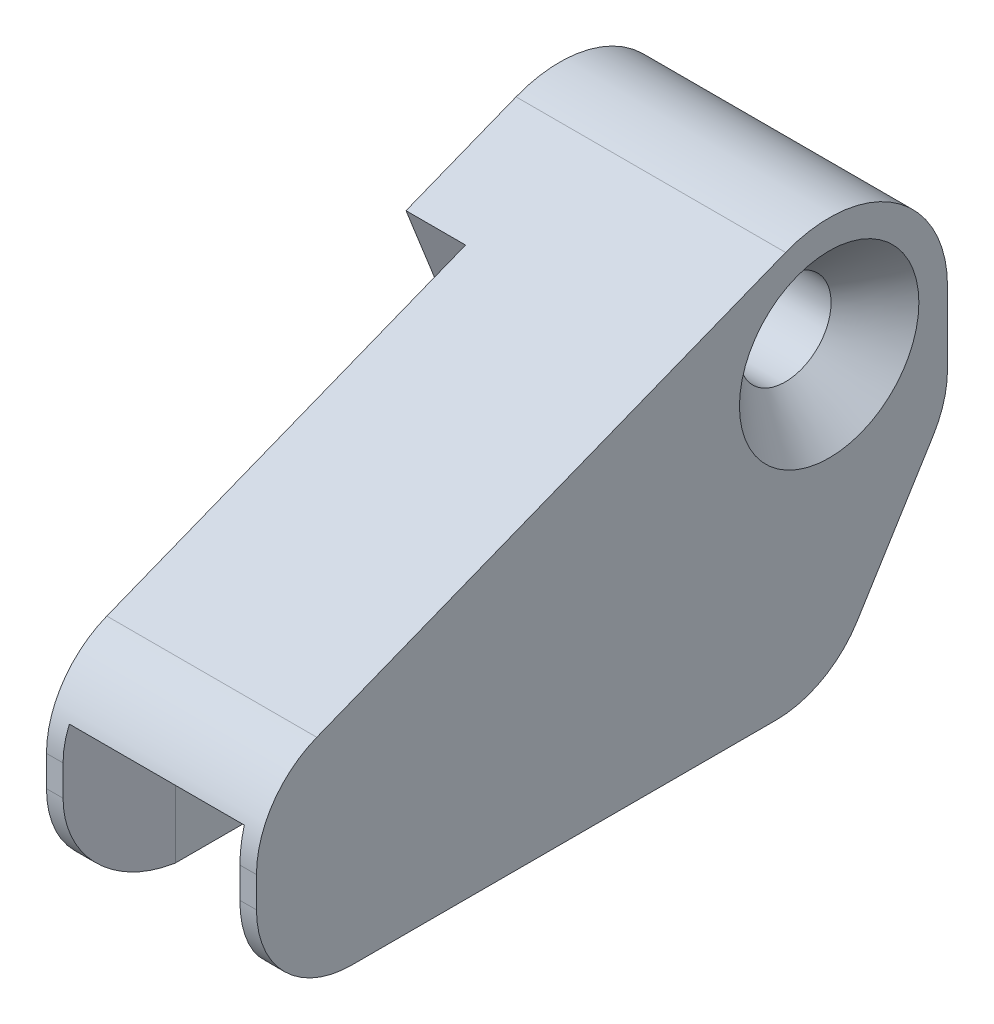
ISO-10303-21;
HEADER;
FILE_DESCRIPTION(('STEP AP214'),'2;1');
FILE_NAME('part.step','',(''),(''),'','','');
FILE_SCHEMA(('AUTOMOTIVE_DESIGN { 1 0 10303 214 1 1 1 1 }'));
ENDSEC;
DATA;
#1=APPLICATION_CONTEXT('core data for automotive mechanical design processes');
#2=APPLICATION_PROTOCOL_DEFINITION('international standard','automotive_design',2000,#1);
#3=PRODUCT_CONTEXT('',#1,'mechanical');
#4=PRODUCT('Part','Part','',(#3));
#5=PRODUCT_RELATED_PRODUCT_CATEGORY('part','',(#4));
#6=PRODUCT_DEFINITION_FORMATION('','',#4);
#7=PRODUCT_DEFINITION_CONTEXT('part definition',#1,'design');
#8=PRODUCT_DEFINITION('design','',#6,#7);
#9=PRODUCT_DEFINITION_SHAPE('','',#8);
#10=(LENGTH_UNIT() NAMED_UNIT(*) SI_UNIT(.MILLI.,.METRE.));
#11=(NAMED_UNIT(*) PLANE_ANGLE_UNIT() SI_UNIT($,.RADIAN.));
#12=(NAMED_UNIT(*) SI_UNIT($,.STERADIAN.) SOLID_ANGLE_UNIT());
#13=UNCERTAINTY_MEASURE_WITH_UNIT(LENGTH_MEASURE(1.E-05),#10,'distance_accuracy_value','');
#14=(GEOMETRIC_REPRESENTATION_CONTEXT(3) GLOBAL_UNCERTAINTY_ASSIGNED_CONTEXT((#13)) GLOBAL_UNIT_ASSIGNED_CONTEXT((#10,
#11,#12)) REPRESENTATION_CONTEXT('',''));
#15=CARTESIAN_POINT('',(0.,0.,0.));
#16=DIRECTION('',(0.,0.,1.));
#17=DIRECTION('',(1.,0.,0.));
#18=AXIS2_PLACEMENT_3D('',#15,#16,#17);
#19=CARTESIAN_POINT('',(11.,-5.2,-6.2));
#20=DIRECTION('',(0.,0.526939668861675,0.84990269171238));
#21=DIRECTION('',(0.,-0.84990269171238,0.526939668861675));
#22=AXIS2_PLACEMENT_3D('',#19,#20,#21);
#23=PLANE('',#22);
#24=DIRECTION('',(0.,-0.84990269171238,0.526939668861675));
#25=VECTOR('',#24,1.);
#26=CARTESIAN_POINT('',(9.25,-8.62041058295059,-4.07934543857064));
#27=LINE('',#26,#25);
#28=CARTESIAN_POINT('',(9.25,-6.41046216360984,-5.4495134585619));
#29=VERTEX_POINT('',#28);
#30=CARTESIAN_POINT('',(9.25,-12.8346983443084,-1.46648702652881));
#31=VERTEX_POINT('',#30);
#32=EDGE_CURVE('E69',#29,#31,#27,.T.);
#33=ORIENTED_EDGE('',*,*,#32,.F.);
#34=DIRECTION('',(-1.,0.,0.));
#35=VECTOR('',#34,1.);
#36=CARTESIAN_POINT('',(11.,-6.41046216360984,-5.4495134585619));
#37=LINE('',#36,#35);
#38=CARTESIAN_POINT('',(11.,-6.41046216360984,-5.4495134585619));
#39=VERTEX_POINT('',#38);
#40=EDGE_CURVE('E375',#29,#39,#37,.F.);
#41=ORIENTED_EDGE('',*,*,#40,.T.);
#42=DIRECTION('',(0.,0.849902691712379,-0.526939668861675));
#43=VECTOR('',#42,1.);
#44=CARTESIAN_POINT('',(11.,-5.2,-6.2));
#45=LINE('',#44,#43);
#46=CARTESIAN_POINT('',(11.,-12.8346983443084,-1.46648702652881));
#47=VERTEX_POINT('',#46);
#48=EDGE_CURVE('E275',#47,#39,#45,.T.);
#49=ORIENTED_EDGE('',*,*,#48,.F.);
#50=DIRECTION('',(-1.,0.,0.));
#51=VECTOR('',#50,1.);
#52=CARTESIAN_POINT('',(11.,-12.8346983443084,-1.46648702652881));
#53=LINE('',#52,#51);
#54=EDGE_CURVE('E369',#47,#31,#53,.T.);
#55=ORIENTED_EDGE('',*,*,#54,.T.);
#56=EDGE_LOOP('',(#33,#41,#49,#55));
#57=FACE_BOUND('',#56,.T.);
#58=ADVANCED_FACE('F42',(#57),#23,.F.);
#59=CARTESIAN_POINT('',(11.,-15.2,30.));
#60=DIRECTION('',(0.,0.,-1.));
#61=DIRECTION('',(0.,1.,0.));
#62=AXIS2_PLACEMENT_3D('',#59,#60,#61);
#63=PLANE('',#62);
#64=DIRECTION('',(0.,-1.,0.));
#65=VECTOR('',#64,1.);
#66=CARTESIAN_POINT('',(11.,-15.2,30.));
#67=LINE('',#66,#65);
#68=CARTESIAN_POINT('',(11.,-8.59908763706365,30.));
#69=VERTEX_POINT('',#68);
#70=CARTESIAN_POINT('',(11.,-10.2,30.));
#71=VERTEX_POINT('',#70);
#72=EDGE_CURVE('E222',#69,#71,#67,.T.);
#73=ORIENTED_EDGE('',*,*,#72,.F.);
#74=DIRECTION('',(-1.,0.,0.));
#75=VECTOR('',#74,1.);
#76=CARTESIAN_POINT('',(11.,-8.59908763706365,30.));
#77=LINE('',#76,#75);
#78=CARTESIAN_POINT('',(10.1316349035423,-8.59908763706365,30.));
#79=VERTEX_POINT('',#78);
#80=EDGE_CURVE('E329',#69,#79,#77,.T.);
#81=ORIENTED_EDGE('',*,*,#80,.T.);
#82=DIRECTION('',(0.,-1.,0.));
#83=VECTOR('',#82,1.);
#84=CARTESIAN_POINT('',(10.1316349035423,-15.2,30.));
#85=LINE('',#84,#83);
#86=CARTESIAN_POINT('',(10.1316349035423,-10.2,30.));
#87=VERTEX_POINT('',#86);
#88=EDGE_CURVE('E310',#79,#87,#85,.T.);
#89=ORIENTED_EDGE('',*,*,#88,.T.);
#90=DIRECTION('',(-1.,0.,0.));
#91=VECTOR('',#90,1.);
#92=CARTESIAN_POINT('',(11.,-10.2,30.));
#93=LINE('',#92,#91);
#94=EDGE_CURVE('E322',#87,#71,#93,.F.);
#95=ORIENTED_EDGE('',*,*,#94,.T.);
#96=EDGE_LOOP('',(#73,#81,#89,#95));
#97=FACE_BOUND('',#96,.T.);
#98=ADVANCED_FACE('F451',(#97),#63,.F.);
#99=CARTESIAN_POINT('',(11.,-15.2,0.));
#100=DIRECTION('',(0.,1.,0.));
#101=DIRECTION('',(0.,0.,1.));
#102=AXIS2_PLACEMENT_3D('',#99,#100,#101);
#103=PLANE('',#102);
#104=DIRECTION('',(0.,0.,-1.));
#105=VECTOR('',#104,1.);
#106=CARTESIAN_POINT('',(0.,-15.2,0.));
#107=LINE('',#106,#105);
#108=CARTESIAN_POINT('',(0.,-15.2,25.));
#109=VERTEX_POINT('',#108);
#110=CARTESIAN_POINT('',(0.,-15.2,2.78302643203309));
#111=VERTEX_POINT('',#110);
#112=EDGE_CURVE('E261',#109,#111,#107,.T.);
#113=ORIENTED_EDGE('',*,*,#112,.T.);
#114=DIRECTION('',(-1.,0.,0.));
#115=VECTOR('',#114,1.);
#116=CARTESIAN_POINT('',(11.,-15.2,2.78302643203309));
#117=LINE('',#116,#115);
#118=CARTESIAN_POINT('',(1.75,-15.2,2.78302643203309));
#119=VERTEX_POINT('',#118);
#120=EDGE_CURVE('E383',#111,#119,#117,.F.);
#121=ORIENTED_EDGE('',*,*,#120,.T.);
#122=DIRECTION('',(0.,0.,1.));
#123=VECTOR('',#122,1.);
#124=CARTESIAN_POINT('',(1.75,-15.2,-14.6915864338116));
#125=LINE('',#124,#123);
#126=CARTESIAN_POINT('',(1.75,-15.2,24.9999999999999));
#127=VERTEX_POINT('',#126);
#128=EDGE_CURVE('E255',#119,#127,#125,.T.);
#129=ORIENTED_EDGE('',*,*,#128,.T.);
#130=DIRECTION('',(-1.,0.,0.));
#131=VECTOR('',#130,1.);
#132=CARTESIAN_POINT('',(11.,-15.2,25.));
#133=LINE('',#132,#131);
#134=EDGE_CURVE('E379',#127,#109,#133,.T.);
#135=ORIENTED_EDGE('',*,*,#134,.T.);
#136=EDGE_LOOP('',(#113,#121,#129,#135));
#137=FACE_BOUND('',#136,.T.);
#138=ADVANCED_FACE('F457',(#137),#103,.F.);
#139=CARTESIAN_POINT('',(11.,0.,0.));
#140=DIRECTION('',(1.,0.,0.));
#141=DIRECTION('',(0.,0.,-1.));
#142=AXIS2_PLACEMENT_3D('',#139,#140,#141);
#143=PLANE('',#142);
#144=CARTESIAN_POINT('',(11.,0.,0.));
#145=DIRECTION('',(1.,0.,0.));
#146=DIRECTION('',(0.,0.,-1.));
#147=AXIS2_PLACEMENT_3D('',#144,#145,#146);
#148=CIRCLE('',#147,4.7);
#149=CARTESIAN_POINT('',(11.,0.,-4.7));
#150=VERTEX_POINT('',#149);
#151=EDGE_CURVE('E247',#150,#150,#148,.T.);
#152=ORIENTED_EDGE('',*,*,#151,.F.);
#153=EDGE_LOOP('',(#152));
#154=FACE_BOUND('',#153,.T.);
#155=DIRECTION('',(0.,-0.367846965999496,0.929886342304782));
#156=VECTOR('',#155,1.);
#157=CARTESIAN_POINT('',(11.,-5.2,30.));
#158=LINE('',#157,#156);
#159=CARTESIAN_POINT('',(11.,5.76529532228965,2.28065118919687));
#160=VERTEX_POINT('',#159);
#161=CARTESIAN_POINT('',(11.,-3.94965592553974,26.8392348299975));
#162=VERTEX_POINT('',#161);
#163=EDGE_CURVE('E217',#160,#162,#158,.T.);
#164=ORIENTED_EDGE('',*,*,#163,.T.);
#165=CARTESIAN_POINT('',(11.,-8.59908763706365,25.));
#166=DIRECTION('',(1.,0.,0.));
#167=DIRECTION('',(0.,0.,-1.));
#168=AXIS2_PLACEMENT_3D('',#165,#166,#167);
#169=CIRCLE('',#168,5.);
#170=EDGE_CURVE('E363',#162,#69,#169,.T.);
#171=ORIENTED_EDGE('',*,*,#170,.T.);
#172=ORIENTED_EDGE('',*,*,#72,.T.);
#173=CARTESIAN_POINT('',(11.,-10.2,25.));
#174=DIRECTION('',(1.,0.,0.));
#175=DIRECTION('',(0.,0.,-1.));
#176=AXIS2_PLACEMENT_3D('',#173,#174,#175);
#177=CIRCLE('',#176,5.);
#178=CARTESIAN_POINT('',(11.,-15.2,25.));
#179=VERTEX_POINT('',#178);
#180=EDGE_CURVE('E355',#71,#179,#177,.T.);
#181=ORIENTED_EDGE('',*,*,#180,.T.);
#182=DIRECTION('',(0.,0.,-1.));
#183=VECTOR('',#182,1.);
#184=CARTESIAN_POINT('',(11.,-15.2,0.));
#185=LINE('',#184,#183);
#186=CARTESIAN_POINT('',(11.,-15.2,2.78302643203309));
#187=VERTEX_POINT('',#186);
#188=EDGE_CURVE('E271',#179,#187,#185,.T.);
#189=ORIENTED_EDGE('',*,*,#188,.T.);
#190=CARTESIAN_POINT('',(11.,-10.2,2.78302643203309));
#191=DIRECTION('',(1.,0.,0.));
#192=DIRECTION('',(0.,0.,-1.));
#193=AXIS2_PLACEMENT_3D('',#190,#191,#192);
#194=CIRCLE('',#193,5.);
#195=EDGE_CURVE('E357',#187,#47,#194,.T.);
#196=ORIENTED_EDGE('',*,*,#195,.T.);
#197=ORIENTED_EDGE('',*,*,#48,.T.);
#198=CARTESIAN_POINT('',(11.,-3.77576381930147,-1.2));
#199=DIRECTION('',(1.,0.,0.));
#200=DIRECTION('',(0.,0.,-1.));
#201=AXIS2_PLACEMENT_3D('',#198,#199,#200);
#202=CIRCLE('',#201,5.);
#203=CARTESIAN_POINT('',(11.,-3.77576381930147,-6.2));
#204=VERTEX_POINT('',#203);
#205=EDGE_CURVE('E360',#39,#204,#202,.T.);
#206=ORIENTED_EDGE('',*,*,#205,.T.);
#207=DIRECTION('',(0.,1.,0.));
#208=VECTOR('',#207,1.);
#209=CARTESIAN_POINT('',(11.,0.,-6.2));
#210=LINE('',#209,#208);
#211=CARTESIAN_POINT('',(11.,0.,-6.2));
#212=VERTEX_POINT('',#211);
#213=EDGE_CURVE('E280',#204,#212,#210,.T.);
#214=ORIENTED_EDGE('',*,*,#213,.T.);
#215=CARTESIAN_POINT('',(11.,0.,0.));
#216=DIRECTION('',(1.,0.,0.));
#217=DIRECTION('',(0.,0.,-1.));
#218=AXIS2_PLACEMENT_3D('',#215,#216,#217);
#219=CIRCLE('',#218,6.2);
#220=EDGE_CURVE('E283',#212,#160,#219,.T.);
#221=ORIENTED_EDGE('',*,*,#220,.T.);
#222=EDGE_LOOP('',(#164,#171,#172,#181,#189,#196,#197,#206,#214,#221));
#223=FACE_BOUND('',#222,.T.);
#224=ADVANCED_FACE('F448',(#154,#223),#143,.T.);
#225=CARTESIAN_POINT('',(0.,0.,0.));
#226=DIRECTION('',(1.,0.,0.));
#227=DIRECTION('',(0.,0.,-1.));
#228=AXIS2_PLACEMENT_3D('',#225,#226,#227);
#229=PLANE('',#228);
#230=DIRECTION('',(0.,0.929886342304782,0.367846965999496));
#231=VECTOR('',#230,1.);
#232=CARTESIAN_POINT('',(0.,3.48464413309277,8.04594651148652));
#233=LINE('',#232,#231);
#234=CARTESIAN_POINT('',(0.,-2.28065118919687,5.76529532228965));
#235=VERTEX_POINT('',#234);
#236=CARTESIAN_POINT('',(0.,3.48464413309278,8.04594651148652));
#237=VERTEX_POINT('',#236);
#238=EDGE_CURVE('E237',#235,#237,#233,.T.);
#239=ORIENTED_EDGE('',*,*,#238,.F.);
#240=CARTESIAN_POINT('',(0.,0.,0.));
#241=DIRECTION('',(-1.,0.,0.));
#242=DIRECTION('',(0.,0.,1.));
#243=AXIS2_PLACEMENT_3D('',#240,#241,#242);
#244=CIRCLE('',#243,6.2);
#245=CARTESIAN_POINT('',(0.,0.,-6.2));
#246=VERTEX_POINT('',#245);
#247=EDGE_CURVE('E11',#246,#235,#244,.T.);
#248=ORIENTED_EDGE('',*,*,#247,.F.);
#249=DIRECTION('',(0.,1.,0.));
#250=VECTOR('',#249,1.);
#251=CARTESIAN_POINT('',(0.,0.,-6.2));
#252=LINE('',#251,#250);
#253=CARTESIAN_POINT('',(0.,-3.77576381930147,-6.2));
#254=VERTEX_POINT('',#253);
#255=EDGE_CURVE('E295',#254,#246,#252,.T.);
#256=ORIENTED_EDGE('',*,*,#255,.F.);
#257=CARTESIAN_POINT('',(0.,-3.77576381930147,-1.2));
#258=DIRECTION('',(1.,0.,0.));
#259=DIRECTION('',(0.,0.,-1.));
#260=AXIS2_PLACEMENT_3D('',#257,#258,#259);
#261=CIRCLE('',#260,5.);
#262=CARTESIAN_POINT('',(0.,-6.41046216360984,-5.4495134585619));
#263=VERTEX_POINT('',#262);
#264=EDGE_CURVE('E348',#254,#263,#261,.F.);
#265=ORIENTED_EDGE('',*,*,#264,.T.);
#266=DIRECTION('',(0.,0.849902691712379,-0.526939668861675));
#267=VECTOR('',#266,1.);
#268=CARTESIAN_POINT('',(0.,-5.2,-6.2));
#269=LINE('',#268,#267);
#270=CARTESIAN_POINT('',(0.,-12.8346983443084,-1.46648702652881));
#271=VERTEX_POINT('',#270);
#272=EDGE_CURVE('E292',#271,#263,#269,.T.);
#273=ORIENTED_EDGE('',*,*,#272,.F.);
#274=CARTESIAN_POINT('',(0.,-10.2,2.78302643203309));
#275=DIRECTION('',(1.,0.,0.));
#276=DIRECTION('',(0.,0.,-1.));
#277=AXIS2_PLACEMENT_3D('',#274,#275,#276);
#278=CIRCLE('',#277,5.);
#279=EDGE_CURVE('E346',#271,#111,#278,.F.);
#280=ORIENTED_EDGE('',*,*,#279,.T.);
#281=ORIENTED_EDGE('',*,*,#112,.F.);
#282=CARTESIAN_POINT('',(0.,-10.2,25.));
#283=DIRECTION('',(1.,0.,0.));
#284=DIRECTION('',(0.,0.,-1.));
#285=AXIS2_PLACEMENT_3D('',#282,#283,#284);
#286=CIRCLE('',#285,5.);
#287=CARTESIAN_POINT('',(0.,-10.2,30.));
#288=VERTEX_POINT('',#287);
#289=EDGE_CURVE('E343',#109,#288,#286,.F.);
#290=ORIENTED_EDGE('',*,*,#289,.T.);
#291=DIRECTION('',(0.,-1.,0.));
#292=VECTOR('',#291,1.);
#293=CARTESIAN_POINT('',(0.,-15.2,30.));
#294=LINE('',#293,#292);
#295=CARTESIAN_POINT('',(0.,-8.59908763706365,30.));
#296=VERTEX_POINT('',#295);
#297=EDGE_CURVE('E276',#296,#288,#294,.T.);
#298=ORIENTED_EDGE('',*,*,#297,.F.);
#299=CARTESIAN_POINT('',(0.,-8.59908763706365,25.));
#300=DIRECTION('',(1.,0.,0.));
#301=DIRECTION('',(0.,0.,-1.));
#302=AXIS2_PLACEMENT_3D('',#299,#300,#301);
#303=CIRCLE('',#302,5.);
#304=CARTESIAN_POINT('',(0.,-3.94965592553974,26.8392348299975));
#305=VERTEX_POINT('',#304);
#306=EDGE_CURVE('E351',#296,#305,#303,.F.);
#307=ORIENTED_EDGE('',*,*,#306,.T.);
#308=DIRECTION('',(0.,-0.367846965999496,0.929886342304782));
#309=VECTOR('',#308,1.);
#310=CARTESIAN_POINT('',(0.,-5.2,30.));
#311=LINE('',#310,#309);
#312=EDGE_CURVE('E58',#237,#305,#311,.T.);
#313=ORIENTED_EDGE('',*,*,#312,.F.);
#314=EDGE_LOOP('',(#239,#248,#256,#265,#273,#280,#281,#290,#298,#307,#313));
#315=FACE_BOUND('',#314,.T.);
#316=ADVANCED_FACE('F471',(#315),#229,.F.);
#317=DIRECTION('',(0.,0.,1.));
#318=VECTOR('',#317,1.);
#319=CARTESIAN_POINT('',(9.25,-15.2,-14.6915864338116));
#320=LINE('',#319,#318);
#321=CARTESIAN_POINT('',(9.25,-15.2,2.78302643203309));
#322=VERTEX_POINT('',#321);
#323=CARTESIAN_POINT('',(9.25,-15.2,24.9999999999999));
#324=VERTEX_POINT('',#323);
#325=EDGE_CURVE('E265',#322,#324,#320,.T.);
#326=ORIENTED_EDGE('',*,*,#325,.F.);
#327=DIRECTION('',(-1.,0.,0.));
#328=VECTOR('',#327,1.);
#329=CARTESIAN_POINT('',(11.,-15.2,2.78302643203309));
#330=LINE('',#329,#328);
#331=EDGE_CURVE('E396',#322,#187,#330,.F.);
#332=ORIENTED_EDGE('',*,*,#331,.T.);
#333=ORIENTED_EDGE('',*,*,#188,.F.);
#334=DIRECTION('',(-1.,0.,0.));
#335=VECTOR('',#334,1.);
#336=CARTESIAN_POINT('',(11.,-15.2,25.));
#337=LINE('',#336,#335);
#338=EDGE_CURVE('E392',#179,#324,#337,.T.);
#339=ORIENTED_EDGE('',*,*,#338,.T.);
#340=EDGE_LOOP('',(#326,#332,#333,#339));
#341=FACE_BOUND('',#340,.T.);
#342=ADVANCED_FACE('F441',(#341),#103,.F.);
#343=CARTESIAN_POINT('',(1.75,-6.41046216360984,-5.4495134585619));
#344=VERTEX_POINT('',#343);
#345=EDGE_CURVE('E376',#263,#344,#37,.F.);
#346=ORIENTED_EDGE('',*,*,#345,.T.);
#347=DIRECTION('',(0.,0.84990269171238,-0.526939668861675));
#348=VECTOR('',#347,1.);
#349=CARTESIAN_POINT('',(1.75,-8.62041058295059,-4.07934543857064));
#350=LINE('',#349,#348);
#351=CARTESIAN_POINT('',(1.75,-12.8346983443084,-1.46648702652881));
#352=VERTEX_POINT('',#351);
#353=EDGE_CURVE('E258',#352,#344,#350,.T.);
#354=ORIENTED_EDGE('',*,*,#353,.F.);
#355=DIRECTION('',(-1.,0.,0.));
#356=VECTOR('',#355,1.);
#357=CARTESIAN_POINT('',(11.,-12.8346983443084,-1.46648702652881));
#358=LINE('',#357,#356);
#359=EDGE_CURVE('E372',#352,#271,#358,.T.);
#360=ORIENTED_EDGE('',*,*,#359,.T.);
#361=ORIENTED_EDGE('',*,*,#272,.T.);
#362=EDGE_LOOP('',(#346,#354,#360,#361));
#363=FACE_BOUND('',#362,.T.);
#364=ADVANCED_FACE('F453',(#363),#23,.F.);
#365=CARTESIAN_POINT('',(11.,0.,-6.2));
#366=DIRECTION('',(0.,0.,1.));
#367=DIRECTION('',(0.,-1.,0.));
#368=AXIS2_PLACEMENT_3D('',#365,#366,#367);
#369=PLANE('',#368);
#370=ORIENTED_EDGE('',*,*,#213,.F.);
#371=DIRECTION('',(-1.,0.,0.));
#372=VECTOR('',#371,1.);
#373=CARTESIAN_POINT('',(11.,-3.77576381930147,-6.2));
#374=LINE('',#373,#372);
#375=EDGE_CURVE('E365',#204,#254,#374,.T.);
#376=ORIENTED_EDGE('',*,*,#375,.T.);
#377=ORIENTED_EDGE('',*,*,#255,.T.);
#378=DIRECTION('',(-1.,0.,0.));
#379=VECTOR('',#378,1.);
#380=CARTESIAN_POINT('',(11.,0.,-6.2));
#381=LINE('',#380,#379);
#382=EDGE_CURVE('E221',#212,#246,#381,.T.);
#383=ORIENTED_EDGE('',*,*,#382,.F.);
#384=EDGE_LOOP('',(#370,#376,#377,#383));
#385=FACE_BOUND('',#384,.T.);
#386=ADVANCED_FACE('F464',(#385),#369,.F.);
#387=CARTESIAN_POINT('',(11.,0.,0.));
#388=DIRECTION('',(-1.,0.,0.));
#389=DIRECTION('',(0.,0.,1.));
#390=AXIS2_PLACEMENT_3D('',#387,#388,#389);
#391=CYLINDRICAL_SURFACE('',#390,6.2);
#392=ORIENTED_EDGE('',*,*,#382,.T.);
#393=ORIENTED_EDGE('',*,*,#247,.T.);
#394=DIRECTION('',(1.,0.,0.));
#395=VECTOR('',#394,1.);
#396=CARTESIAN_POINT('',(-3.12,-2.28065118919687,5.76529532228965));
#397=LINE('',#396,#395);
#398=CARTESIAN_POINT('',(-3.12,-2.28065118919687,5.76529532228965));
#399=VERTEX_POINT('',#398);
#400=EDGE_CURVE('E229',#399,#235,#397,.T.);
#401=ORIENTED_EDGE('',*,*,#400,.F.);
#402=CARTESIAN_POINT('',(-3.12,0.,0.));
#403=DIRECTION('',(-1.,0.,0.));
#404=DIRECTION('',(0.,0.,1.));
#405=AXIS2_PLACEMENT_3D('',#402,#403,#404);
#406=CIRCLE('',#405,6.2);
#407=CARTESIAN_POINT('',(-3.12,5.76529532228965,2.28065118919687));
#408=VERTEX_POINT('',#407);
#409=EDGE_CURVE('E225',#408,#399,#406,.T.);
#410=ORIENTED_EDGE('',*,*,#409,.F.);
#411=DIRECTION('',(-1.,0.,0.));
#412=VECTOR('',#411,1.);
#413=CARTESIAN_POINT('',(11.,5.76529532228965,2.28065118919687));
#414=LINE('',#413,#412);
#415=EDGE_CURVE('E210',#160,#408,#414,.T.);
#416=ORIENTED_EDGE('',*,*,#415,.F.);
#417=ORIENTED_EDGE('',*,*,#220,.F.);
#418=EDGE_LOOP('',(#392,#393,#401,#410,#416,#417));
#419=FACE_BOUND('',#418,.T.);
#420=ADVANCED_FACE('F227',(#419),#391,.T.);
#421=CARTESIAN_POINT('',(11.,-5.2,30.));
#422=DIRECTION('',(0.,-0.929886342304782,-0.367846965999496));
#423=DIRECTION('',(0.,0.367846965999496,-0.929886342304782));
#424=AXIS2_PLACEMENT_3D('',#421,#422,#423);
#425=PLANE('',#424);
#426=ORIENTED_EDGE('',*,*,#415,.T.);
#427=DIRECTION('',(0.,0.367846965999496,-0.929886342304782));
#428=VECTOR('',#427,1.);
#429=CARTESIAN_POINT('',(-3.12,3.48464413309277,8.04594651148652));
#430=LINE('',#429,#428);
#431=CARTESIAN_POINT('',(-3.12,3.48464413309277,8.04594651148652));
#432=VERTEX_POINT('',#431);
#433=EDGE_CURVE('E215',#432,#408,#430,.T.);
#434=ORIENTED_EDGE('',*,*,#433,.F.);
#435=DIRECTION('',(1.,0.,0.));
#436=VECTOR('',#435,1.);
#437=CARTESIAN_POINT('',(-3.12,3.48464413309277,8.04594651148652));
#438=LINE('',#437,#436);
#439=EDGE_CURVE('E243',#432,#237,#438,.T.);
#440=ORIENTED_EDGE('',*,*,#439,.T.);
#441=ORIENTED_EDGE('',*,*,#312,.T.);
#442=DIRECTION('',(-1.,0.,0.));
#443=VECTOR('',#442,1.);
#444=CARTESIAN_POINT('',(11.,-3.94965592553974,26.8392348299975));
#445=LINE('',#444,#443);
#446=EDGE_CURVE('E353',#305,#162,#445,.F.);
#447=ORIENTED_EDGE('',*,*,#446,.T.);
#448=ORIENTED_EDGE('',*,*,#163,.F.);
#449=EDGE_LOOP('',(#426,#434,#440,#441,#447,#448));
#450=FACE_BOUND('',#449,.T.);
#451=ADVANCED_FACE('F212',(#450),#425,.F.);
#452=DIRECTION('',(0.,1.,0.));
#453=VECTOR('',#452,1.);
#454=CARTESIAN_POINT('',(0.868365096457673,-15.2,30.));
#455=LINE('',#454,#453);
#456=CARTESIAN_POINT('',(0.868365096457673,-10.2,30.));
#457=VERTEX_POINT('',#456);
#458=CARTESIAN_POINT('',(0.868365096457673,-8.59908763706365,30.));
#459=VERTEX_POINT('',#458);
#460=EDGE_CURVE('E307',#457,#459,#455,.T.);
#461=ORIENTED_EDGE('',*,*,#460,.T.);
#462=DIRECTION('',(-1.,0.,0.));
#463=VECTOR('',#462,1.);
#464=CARTESIAN_POINT('',(11.,-8.59908763706365,30.));
#465=LINE('',#464,#463);
#466=EDGE_CURVE('E327',#459,#296,#465,.T.);
#467=ORIENTED_EDGE('',*,*,#466,.T.);
#468=ORIENTED_EDGE('',*,*,#297,.T.);
#469=DIRECTION('',(-1.,0.,0.));
#470=VECTOR('',#469,1.);
#471=CARTESIAN_POINT('',(11.,-10.2,30.));
#472=LINE('',#471,#470);
#473=EDGE_CURVE('E324',#288,#457,#472,.F.);
#474=ORIENTED_EDGE('',*,*,#473,.T.);
#475=EDGE_LOOP('',(#461,#467,#468,#474));
#476=FACE_BOUND('',#475,.T.);
#477=ADVANCED_FACE('F460',(#476),#63,.F.);
#478=CARTESIAN_POINT('',(1.75,-15.2,-14.6915864338116));
#479=DIRECTION('',(-1.,0.,0.));
#480=DIRECTION('',(0.,0.,1.));
#481=AXIS2_PLACEMENT_3D('',#478,#479,#480);
#482=PLANE('',#481);
#483=ORIENTED_EDGE('',*,*,#128,.F.);
#484=CARTESIAN_POINT('',(1.75,-10.2,2.78302643203309));
#485=DIRECTION('',(-1.,0.,0.));
#486=DIRECTION('',(0.,0.,1.));
#487=AXIS2_PLACEMENT_3D('',#484,#485,#486);
#488=CIRCLE('',#487,5.);
#489=EDGE_CURVE('E386',#119,#352,#488,.F.);
#490=ORIENTED_EDGE('',*,*,#489,.T.);
#491=ORIENTED_EDGE('',*,*,#353,.T.);
#492=CARTESIAN_POINT('',(1.75,-3.77576381930147,-1.2));
#493=DIRECTION('',(-1.,0.,0.));
#494=DIRECTION('',(0.,0.,1.));
#495=AXIS2_PLACEMENT_3D('',#492,#493,#494);
#496=CIRCLE('',#495,5.);
#497=CARTESIAN_POINT('',(1.75,-4.38452496596373,-6.16280262213948));
#498=VERTEX_POINT('',#497);
#499=EDGE_CURVE('E407',#498,#344,#496,.T.);
#500=ORIENTED_EDGE('',*,*,#499,.F.);
#501=DIRECTION('',(0.,0.618423306720149,-0.78584515886103));
#502=VECTOR('',#501,1.);
#503=CARTESIAN_POINT('',(1.75,-4.37601445009356,-6.17361713644271));
#504=LINE('',#503,#502);
#505=CARTESIAN_POINT('',(1.75,-6.95,-2.90279266816703));
#506=VERTEX_POINT('',#505);
#507=EDGE_CURVE('E46',#498,#506,#504,.F.);
#508=ORIENTED_EDGE('',*,*,#507,.T.);
#509=DIRECTION('',(0.,0.,1.));
#510=VECTOR('',#509,1.);
#511=CARTESIAN_POINT('',(1.75,-6.95,-14.6915864338116));
#512=LINE('',#511,#510);
#513=CARTESIAN_POINT('',(1.75,-6.95,24.9999999999999));
#514=VERTEX_POINT('',#513);
#515=EDGE_CURVE('E259',#506,#514,#512,.T.);
#516=ORIENTED_EDGE('',*,*,#515,.T.);
#517=DIRECTION('',(0.,-1.,0.));
#518=VECTOR('',#517,1.);
#519=CARTESIAN_POINT('',(1.75,-15.2,24.9999999999999));
#520=LINE('',#519,#518);
#521=EDGE_CURVE('E313',#514,#127,#520,.T.);
#522=ORIENTED_EDGE('',*,*,#521,.T.);
#523=EDGE_LOOP('',(#483,#490,#491,#500,#508,#516,#522));
#524=FACE_BOUND('',#523,.T.);
#525=ADVANCED_FACE('F421',(#524),#482,.F.);
#526=CARTESIAN_POINT('',(1.75,-6.95,-14.6915864338116));
#527=DIRECTION('',(0.,1.,0.));
#528=DIRECTION('',(0.,0.,1.));
#529=AXIS2_PLACEMENT_3D('',#526,#527,#528);
#530=PLANE('',#529);
#531=ORIENTED_EDGE('',*,*,#515,.F.);
#532=DIRECTION('',(1.,0.,0.));
#533=VECTOR('',#532,1.);
#534=CARTESIAN_POINT('',(1.75,-6.95,-2.90279266816703));
#535=LINE('',#534,#533);
#536=CARTESIAN_POINT('',(9.25,-6.95,-2.90279266816703));
#537=VERTEX_POINT('',#536);
#538=EDGE_CURVE('E399',#506,#537,#535,.T.);
#539=ORIENTED_EDGE('',*,*,#538,.T.);
#540=DIRECTION('',(0.,0.,1.));
#541=VECTOR('',#540,1.);
#542=CARTESIAN_POINT('',(9.25,-6.95,-14.6915864338116));
#543=LINE('',#542,#541);
#544=CARTESIAN_POINT('',(9.25,-6.95,24.9999999999999));
#545=VERTEX_POINT('',#544);
#546=EDGE_CURVE('E263',#537,#545,#543,.T.);
#547=ORIENTED_EDGE('',*,*,#546,.T.);
#548=DIRECTION('',(-0.173648177666927,0.,-0.984807753012209));
#549=VECTOR('',#548,1.);
#550=CARTESIAN_POINT('',(2.2361862874896,-6.95,-14.7773141939465));
#551=LINE('',#550,#549);
#552=CARTESIAN_POINT('',(10.0823027594312,-6.95,29.7202235079797));
#553=VERTEX_POINT('',#552);
#554=EDGE_CURVE('E316',#545,#553,#551,.F.);
#555=ORIENTED_EDGE('',*,*,#554,.T.);
#556=DIRECTION('',(-1.,0.,0.));
#557=VECTOR('',#556,1.);
#558=CARTESIAN_POINT('',(10.0823027594312,-6.95,29.7202235079797));
#559=LINE('',#558,#557);
#560=CARTESIAN_POINT('',(0.91769724056882,-6.95,29.7202235079797));
#561=VERTEX_POINT('',#560);
#562=EDGE_CURVE('E336',#553,#561,#559,.T.);
#563=ORIENTED_EDGE('',*,*,#562,.T.);
#564=DIRECTION('',(-0.173648177666927,0.,0.984807753012209));
#565=VECTOR('',#564,1.);
#566=CARTESIAN_POINT('',(8.53766104045757,-6.95,-13.4947386564753));
#567=LINE('',#566,#565);
#568=EDGE_CURVE('E319',#561,#514,#567,.F.);
#569=ORIENTED_EDGE('',*,*,#568,.T.);
#570=EDGE_LOOP('',(#531,#539,#547,#555,#563,#569));
#571=FACE_BOUND('',#570,.T.);
#572=ADVANCED_FACE('F426',(#571),#530,.F.);
#573=CARTESIAN_POINT('',(9.25,-15.2,-14.6915864338116));
#574=DIRECTION('',(1.,0.,0.));
#575=DIRECTION('',(0.,0.,-1.));
#576=AXIS2_PLACEMENT_3D('',#573,#574,#575);
#577=PLANE('',#576);
#578=ORIENTED_EDGE('',*,*,#32,.T.);
#579=CARTESIAN_POINT('',(9.25,-10.2,2.78302643203309));
#580=DIRECTION('',(1.,0.,0.));
#581=DIRECTION('',(0.,0.,-1.));
#582=AXIS2_PLACEMENT_3D('',#579,#580,#581);
#583=CIRCLE('',#582,5.);
#584=EDGE_CURVE('E389',#31,#322,#583,.F.);
#585=ORIENTED_EDGE('',*,*,#584,.T.);
#586=ORIENTED_EDGE('',*,*,#325,.T.);
#587=DIRECTION('',(0.,1.,0.));
#588=VECTOR('',#587,1.);
#589=CARTESIAN_POINT('',(9.25,-15.2,24.9999999999999));
#590=LINE('',#589,#588);
#591=EDGE_CURVE('E304',#324,#545,#590,.T.);
#592=ORIENTED_EDGE('',*,*,#591,.T.);
#593=ORIENTED_EDGE('',*,*,#546,.F.);
#594=DIRECTION('',(0.,-0.618423306720149,0.78584515886103));
#595=VECTOR('',#594,1.);
#596=CARTESIAN_POINT('',(9.25,-4.37601445009356,-6.17361713644271));
#597=LINE('',#596,#595);
#598=CARTESIAN_POINT('',(9.25,-4.38452496596373,-6.16280262213948));
#599=VERTEX_POINT('',#598);
#600=EDGE_CURVE('E413',#537,#599,#597,.F.);
#601=ORIENTED_EDGE('',*,*,#600,.T.);
#602=CARTESIAN_POINT('',(9.25,-3.77576381930147,-1.2));
#603=DIRECTION('',(1.,0.,0.));
#604=DIRECTION('',(0.,0.,-1.));
#605=AXIS2_PLACEMENT_3D('',#602,#603,#604);
#606=CIRCLE('',#605,5.);
#607=EDGE_CURVE('E410',#29,#599,#606,.T.);
#608=ORIENTED_EDGE('',*,*,#607,.F.);
#609=EDGE_LOOP('',(#578,#585,#586,#592,#593,#601,#608));
#610=FACE_BOUND('',#609,.T.);
#611=ADVANCED_FACE('F434',(#610),#577,.F.);
#612=CARTESIAN_POINT('',(9.25,-15.2,24.9999999999999));
#613=DIRECTION('',(0.984807753012209,0.,-0.173648177666927));
#614=DIRECTION('',(0.,1.,0.));
#615=AXIS2_PLACEMENT_3D('',#612,#613,#614);
#616=PLANE('',#615);
#617=ORIENTED_EDGE('',*,*,#88,.F.);
#618=CARTESIAN_POINT('',(9.25000000000002,-8.59908763706365,25.));
#619=DIRECTION('',(0.984807753012209,0.,-0.173648177666927));
#620=DIRECTION('',(-0.173648177666927,0.,-0.984807753012209));
#621=AXIS2_PLACEMENT_3D('',#618,#619,#620);
#622=ELLIPSE('',#621,5.07713305942872,5.);
#623=EDGE_CURVE('E334',#79,#553,#622,.F.);
#624=ORIENTED_EDGE('',*,*,#623,.T.);
#625=ORIENTED_EDGE('',*,*,#554,.F.);
#626=ORIENTED_EDGE('',*,*,#591,.F.);
#627=CARTESIAN_POINT('',(9.25000000000002,-10.2,25.));
#628=DIRECTION('',(0.984807753012209,0.,-0.173648177666927));
#629=DIRECTION('',(-0.173648177666927,0.,-0.984807753012209));
#630=AXIS2_PLACEMENT_3D('',#627,#628,#629);
#631=ELLIPSE('',#630,5.07713305942872,5.);
#632=EDGE_CURVE('E332',#324,#87,#631,.F.);
#633=ORIENTED_EDGE('',*,*,#632,.T.);
#634=EDGE_LOOP('',(#617,#624,#625,#626,#633));
#635=FACE_BOUND('',#634,.T.);
#636=ADVANCED_FACE('F496',(#635),#616,.F.);
#637=CARTESIAN_POINT('',(1.75,-15.2,24.9999999999999));
#638=DIRECTION('',(-0.984807753012209,0.,-0.173648177666927));
#639=DIRECTION('',(0.,-1.,0.));
#640=AXIS2_PLACEMENT_3D('',#637,#638,#639);
#641=PLANE('',#640);
#642=ORIENTED_EDGE('',*,*,#568,.F.);
#643=CARTESIAN_POINT('',(1.74999999999998,-8.59908763706365,25.));
#644=DIRECTION('',(-0.984807753012209,0.,-0.173648177666927));
#645=DIRECTION('',(-0.173648177666927,0.,0.984807753012209));
#646=AXIS2_PLACEMENT_3D('',#643,#644,#645);
#647=ELLIPSE('',#646,5.07713305942872,5.);
#648=EDGE_CURVE('E341',#561,#459,#647,.F.);
#649=ORIENTED_EDGE('',*,*,#648,.T.);
#650=ORIENTED_EDGE('',*,*,#460,.F.);
#651=CARTESIAN_POINT('',(1.74999999999998,-10.2,25.));
#652=DIRECTION('',(-0.984807753012209,0.,-0.173648177666927));
#653=DIRECTION('',(-0.173648177666927,0.,0.984807753012209));
#654=AXIS2_PLACEMENT_3D('',#651,#652,#653);
#655=ELLIPSE('',#654,5.07713305942872,5.);
#656=EDGE_CURVE('E338',#457,#127,#655,.F.);
#657=ORIENTED_EDGE('',*,*,#656,.T.);
#658=ORIENTED_EDGE('',*,*,#521,.F.);
#659=EDGE_LOOP('',(#642,#649,#650,#657,#658));
#660=FACE_BOUND('',#659,.T.);
#661=ADVANCED_FACE('F502',(#660),#641,.F.);
#662=CARTESIAN_POINT('',(11.,-8.59908763706365,25.));
#663=DIRECTION('',(-1.,0.,0.));
#664=DIRECTION('',(0.,0.,1.));
#665=AXIS2_PLACEMENT_3D('',#662,#663,#664);
#666=CYLINDRICAL_SURFACE('',#665,5.);
#667=ORIENTED_EDGE('',*,*,#170,.F.);
#668=ORIENTED_EDGE('',*,*,#446,.F.);
#669=ORIENTED_EDGE('',*,*,#306,.F.);
#670=ORIENTED_EDGE('',*,*,#466,.F.);
#671=ORIENTED_EDGE('',*,*,#648,.F.);
#672=ORIENTED_EDGE('',*,*,#562,.F.);
#673=ORIENTED_EDGE('',*,*,#623,.F.);
#674=ORIENTED_EDGE('',*,*,#80,.F.);
#675=EDGE_LOOP('',(#667,#668,#669,#670,#671,#672,#673,#674));
#676=FACE_BOUND('',#675,.T.);
#677=ADVANCED_FACE('F487',(#676),#666,.T.);
#678=CARTESIAN_POINT('',(11.,-3.77576381930147,-1.2));
#679=DIRECTION('',(-1.,0.,0.));
#680=DIRECTION('',(0.,0.,1.));
#681=AXIS2_PLACEMENT_3D('',#678,#679,#680);
#682=CYLINDRICAL_SURFACE('',#681,5.);
#683=ORIENTED_EDGE('',*,*,#40,.F.);
#684=ORIENTED_EDGE('',*,*,#607,.T.);
#685=DIRECTION('',(-1.,0.,0.));
#686=VECTOR('',#685,1.);
#687=CARTESIAN_POINT('',(5.5,-4.38452496596373,-6.16280262213948));
#688=LINE('',#687,#686);
#689=EDGE_CURVE('E403',#599,#498,#688,.T.);
#690=ORIENTED_EDGE('',*,*,#689,.T.);
#691=ORIENTED_EDGE('',*,*,#499,.T.);
#692=ORIENTED_EDGE('',*,*,#345,.F.);
#693=ORIENTED_EDGE('',*,*,#264,.F.);
#694=ORIENTED_EDGE('',*,*,#375,.F.);
#695=ORIENTED_EDGE('',*,*,#205,.F.);
#696=EDGE_LOOP('',(#683,#684,#690,#691,#692,#693,#694,#695));
#697=FACE_BOUND('',#696,.T.);
#698=ADVANCED_FACE('F431',(#697),#682,.T.);
#699=CARTESIAN_POINT('',(11.,-10.2,2.78302643203309));
#700=DIRECTION('',(-1.,0.,0.));
#701=DIRECTION('',(0.,0.,1.));
#702=AXIS2_PLACEMENT_3D('',#699,#700,#701);
#703=CYLINDRICAL_SURFACE('',#702,5.);
#704=ORIENTED_EDGE('',*,*,#489,.F.);
#705=ORIENTED_EDGE('',*,*,#120,.F.);
#706=ORIENTED_EDGE('',*,*,#279,.F.);
#707=ORIENTED_EDGE('',*,*,#359,.F.);
#708=EDGE_LOOP('',(#704,#705,#706,#707));
#709=FACE_BOUND('',#708,.T.);
#710=ADVANCED_FACE('F513',(#709),#703,.T.);
#711=CARTESIAN_POINT('',(11.,-10.2,2.78302643203309));
#712=DIRECTION('',(-1.,0.,0.));
#713=DIRECTION('',(0.,0.,1.));
#714=AXIS2_PLACEMENT_3D('',#711,#712,#713);
#715=CYLINDRICAL_SURFACE('',#714,5.);
#716=ORIENTED_EDGE('',*,*,#195,.F.);
#717=ORIENTED_EDGE('',*,*,#331,.F.);
#718=ORIENTED_EDGE('',*,*,#584,.F.);
#719=ORIENTED_EDGE('',*,*,#54,.F.);
#720=EDGE_LOOP('',(#716,#717,#718,#719));
#721=FACE_BOUND('',#720,.T.);
#722=ADVANCED_FACE('F445',(#721),#715,.T.);
#723=CARTESIAN_POINT('',(11.,-10.2,25.));
#724=DIRECTION('',(-1.,0.,0.));
#725=DIRECTION('',(0.,0.,1.));
#726=AXIS2_PLACEMENT_3D('',#723,#724,#725);
#727=CYLINDRICAL_SURFACE('',#726,5.);
#728=ORIENTED_EDGE('',*,*,#656,.F.);
#729=ORIENTED_EDGE('',*,*,#473,.F.);
#730=ORIENTED_EDGE('',*,*,#289,.F.);
#731=ORIENTED_EDGE('',*,*,#134,.F.);
#732=EDGE_LOOP('',(#728,#729,#730,#731));
#733=FACE_BOUND('',#732,.T.);
#734=ADVANCED_FACE('F507',(#733),#727,.T.);
#735=CARTESIAN_POINT('',(11.,-10.2,25.));
#736=DIRECTION('',(-1.,0.,0.));
#737=DIRECTION('',(0.,0.,1.));
#738=AXIS2_PLACEMENT_3D('',#735,#736,#737);
#739=CYLINDRICAL_SURFACE('',#738,5.);
#740=ORIENTED_EDGE('',*,*,#180,.F.);
#741=ORIENTED_EDGE('',*,*,#94,.F.);
#742=ORIENTED_EDGE('',*,*,#632,.F.);
#743=ORIENTED_EDGE('',*,*,#338,.F.);
#744=EDGE_LOOP('',(#740,#741,#742,#743));
#745=FACE_BOUND('',#744,.T.);
#746=ADVANCED_FACE('F494',(#745),#739,.T.);
#747=CARTESIAN_POINT('',(1.75,-6.95,-2.90279266816703));
#748=DIRECTION('',(0.,0.78584515886103,0.618423306720149));
#749=DIRECTION('',(1.,0.,0.));
#750=AXIS2_PLACEMENT_3D('',#747,#748,#749);
#751=PLANE('',#750);
#752=ORIENTED_EDGE('',*,*,#507,.F.);
#753=ORIENTED_EDGE('',*,*,#689,.F.);
#754=ORIENTED_EDGE('',*,*,#600,.F.);
#755=ORIENTED_EDGE('',*,*,#538,.F.);
#756=EDGE_LOOP('',(#752,#753,#754,#755));
#757=FACE_BOUND('',#756,.T.);
#758=ADVANCED_FACE('F44',(#757),#751,.F.);
#759=CARTESIAN_POINT('',(11.,0.,0.));
#760=DIRECTION('',(1.,0.,0.));
#761=DIRECTION('',(0.,0.,-1.));
#762=AXIS2_PLACEMENT_3D('',#759,#760,#761);
#763=CYLINDRICAL_SURFACE('',#762,2.4);
#764=CARTESIAN_POINT('',(8.7,0.,0.));
#765=DIRECTION('',(1.,0.,0.));
#766=DIRECTION('',(0.,0.,-1.));
#767=AXIS2_PLACEMENT_3D('',#764,#765,#766);
#768=CIRCLE('',#767,2.4);
#769=CARTESIAN_POINT('',(8.7,0.,-2.4));
#770=VERTEX_POINT('',#769);
#771=EDGE_CURVE('E251',#770,#770,#768,.T.);
#772=ORIENTED_EDGE('',*,*,#771,.T.);
#773=EDGE_LOOP('',(#772));
#774=FACE_BOUND('',#773,.T.);
#775=CARTESIAN_POINT('',(-3.12,0.,0.));
#776=DIRECTION('',(-1.,0.,0.));
#777=DIRECTION('',(0.,0.,1.));
#778=AXIS2_PLACEMENT_3D('',#775,#776,#777);
#779=CIRCLE('',#778,2.4);
#780=CARTESIAN_POINT('',(-3.12,0.,2.4));
#781=VERTEX_POINT('',#780);
#782=EDGE_CURVE('E239',#781,#781,#779,.T.);
#783=ORIENTED_EDGE('',*,*,#782,.T.);
#784=EDGE_LOOP('',(#783));
#785=FACE_BOUND('',#784,.T.);
#786=ADVANCED_FACE('F539',(#774,#785),#763,.F.);
#787=CARTESIAN_POINT('',(11.,0.,0.));
#788=DIRECTION('',(1.,0.,0.));
#789=DIRECTION('',(0.,0.,-1.));
#790=AXIS2_PLACEMENT_3D('',#787,#788,#789);
#791=CONICAL_SURFACE('',#790,4.7,0.785398163397447);
#792=ORIENTED_EDGE('',*,*,#771,.F.);
#793=EDGE_LOOP('',(#792));
#794=FACE_BOUND('',#793,.T.);
#795=ORIENTED_EDGE('',*,*,#151,.T.);
#796=EDGE_LOOP('',(#795));
#797=FACE_BOUND('',#796,.T.);
#798=ADVANCED_FACE('F543',(#794,#797),#791,.F.);
#799=CARTESIAN_POINT('',(-3.12,0.,0.));
#800=DIRECTION('',(-1.,0.,0.));
#801=DIRECTION('',(0.,0.,1.));
#802=AXIS2_PLACEMENT_3D('',#799,#800,#801);
#803=PLANE('',#802);
#804=ORIENTED_EDGE('',*,*,#433,.T.);
#805=ORIENTED_EDGE('',*,*,#409,.T.);
#806=DIRECTION('',(0.,0.929886342304782,0.367846965999496));
#807=VECTOR('',#806,1.);
#808=CARTESIAN_POINT('',(-3.12,3.48464413309277,8.04594651148652));
#809=LINE('',#808,#807);
#810=EDGE_CURVE('E232',#399,#432,#809,.T.);
#811=ORIENTED_EDGE('',*,*,#810,.T.);
#812=EDGE_LOOP('',(#804,#805,#811));
#813=FACE_BOUND('',#812,.T.);
#814=ORIENTED_EDGE('',*,*,#782,.F.);
#815=EDGE_LOOP('',(#814));
#816=FACE_BOUND('',#815,.T.);
#817=ADVANCED_FACE('F234',(#813,#816),#803,.T.);
#818=CARTESIAN_POINT('',(-3.12,3.48464413309277,8.04594651148652));
#819=DIRECTION('',(0.,0.367846965999496,-0.929886342304782));
#820=DIRECTION('',(0.,0.929886342304782,0.367846965999496));
#821=AXIS2_PLACEMENT_3D('',#818,#819,#820);
#822=PLANE('',#821);
#823=ORIENTED_EDGE('',*,*,#238,.T.);
#824=ORIENTED_EDGE('',*,*,#439,.F.);
#825=ORIENTED_EDGE('',*,*,#810,.F.);
#826=ORIENTED_EDGE('',*,*,#400,.T.);
#827=EDGE_LOOP('',(#823,#824,#825,#826));
#828=FACE_BOUND('',#827,.T.);
#829=ADVANCED_FACE('F480',(#828),#822,.F.);
#830=CLOSED_SHELL('',(#58,#98,#138,#224,#316,#342,#364,#386,#420,#451,#477,#525,#572,#611,#636,
#661,#677,#698,#710,#722,#734,#746,#758,#786,#798,#817,#829));
#831=MANIFOLD_SOLID_BREP('B2',#830);
#832=ADVANCED_BREP_SHAPE_REPRESENTATION('',(#18,#831),#14);
#833=SHAPE_DEFINITION_REPRESENTATION(#9,#832);
ENDSEC;
END-ISO-10303-21;
